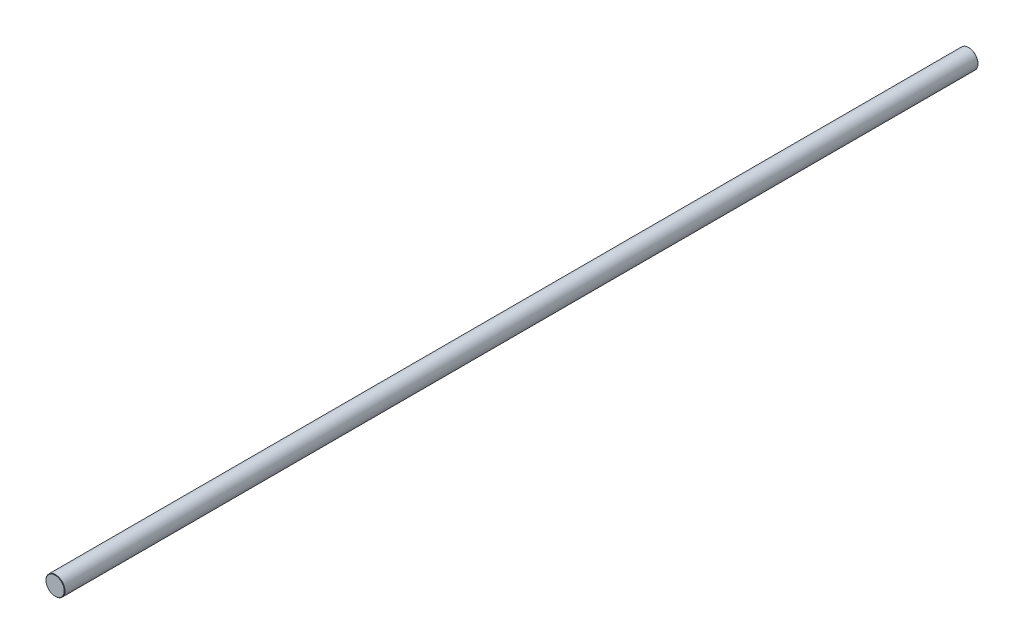
ISO-10303-21;
HEADER;
FILE_DESCRIPTION(('STEP AP214'),'2;1');
FILE_NAME('part.step','',(''),(''),'','','');
FILE_SCHEMA(('AUTOMOTIVE_DESIGN { 1 0 10303 214 1 1 1 1 }'));
ENDSEC;
DATA;
#1=APPLICATION_CONTEXT('core data for automotive mechanical design processes');
#2=APPLICATION_PROTOCOL_DEFINITION('international standard','automotive_design',2000,#1);
#3=PRODUCT_CONTEXT('',#1,'mechanical');
#4=PRODUCT('Part','Part','',(#3));
#5=PRODUCT_RELATED_PRODUCT_CATEGORY('part','',(#4));
#6=PRODUCT_DEFINITION_FORMATION('','',#4);
#7=PRODUCT_DEFINITION_CONTEXT('part definition',#1,'design');
#8=PRODUCT_DEFINITION('design','',#6,#7);
#9=PRODUCT_DEFINITION_SHAPE('','',#8);
#10=(LENGTH_UNIT() NAMED_UNIT(*) SI_UNIT(.MILLI.,.METRE.));
#11=(NAMED_UNIT(*) PLANE_ANGLE_UNIT() SI_UNIT($,.RADIAN.));
#12=(NAMED_UNIT(*) SI_UNIT($,.STERADIAN.) SOLID_ANGLE_UNIT());
#13=UNCERTAINTY_MEASURE_WITH_UNIT(LENGTH_MEASURE(1.E-05),#10,'distance_accuracy_value','');
#14=(GEOMETRIC_REPRESENTATION_CONTEXT(3) GLOBAL_UNCERTAINTY_ASSIGNED_CONTEXT((#13)) GLOBAL_UNIT_ASSIGNED_CONTEXT((#10,
#11,#12)) REPRESENTATION_CONTEXT('',''));
#15=CARTESIAN_POINT('',(0.,0.,0.));
#16=DIRECTION('',(0.,0.,1.));
#17=DIRECTION('',(1.,0.,0.));
#18=AXIS2_PLACEMENT_3D('',#15,#16,#17);
#19=CARTESIAN_POINT('',(0.,0.,600.));
#20=DIRECTION('',(0.,0.,-1.));
#21=DIRECTION('',(-1.,0.,0.));
#22=AXIS2_PLACEMENT_3D('',#19,#20,#21);
#23=CYLINDRICAL_SURFACE('',#22,12.5);
#24=CARTESIAN_POINT('',(0.,0.,-599.5));
#25=DIRECTION('',(0.,0.,1.));
#26=DIRECTION('',(1.,0.,0.));
#27=AXIS2_PLACEMENT_3D('',#24,#25,#26);
#28=CIRCLE('',#27,12.5);
#29=CARTESIAN_POINT('',(12.5,0.,-599.5));
#30=VERTEX_POINT('',#29);
#31=EDGE_CURVE('E50',#30,#30,#28,.T.);
#32=ORIENTED_EDGE('',*,*,#31,.T.);
#33=EDGE_LOOP('',(#32));
#34=FACE_BOUND('',#33,.T.);
#35=CARTESIAN_POINT('',(0.,0.,599.5));
#36=DIRECTION('',(0.,0.,1.));
#37=DIRECTION('',(1.,0.,0.));
#38=AXIS2_PLACEMENT_3D('',#35,#36,#37);
#39=CIRCLE('',#38,12.5);
#40=CARTESIAN_POINT('',(12.5,0.,599.5));
#41=VERTEX_POINT('',#40);
#42=EDGE_CURVE('E54',#41,#41,#39,.F.);
#43=ORIENTED_EDGE('',*,*,#42,.T.);
#44=EDGE_LOOP('',(#43));
#45=FACE_BOUND('',#44,.T.);
#46=ADVANCED_FACE('F39',(#34,#45),#23,.T.);
#47=CARTESIAN_POINT('',(0.,0.,600.));
#48=DIRECTION('',(0.,0.,1.));
#49=DIRECTION('',(1.,0.,0.));
#50=AXIS2_PLACEMENT_3D('',#47,#48,#49);
#51=PLANE('',#50);
#52=CARTESIAN_POINT('',(0.,0.,600.));
#53=DIRECTION('',(0.,0.,1.));
#54=DIRECTION('',(1.,0.,0.));
#55=AXIS2_PLACEMENT_3D('',#52,#53,#54);
#56=CIRCLE('',#55,11.9999999999999);
#57=CARTESIAN_POINT('',(11.9999999999999,0.,600.));
#58=VERTEX_POINT('',#57);
#59=EDGE_CURVE('E10',#58,#58,#56,.T.);
#60=ORIENTED_EDGE('',*,*,#59,.T.);
#61=EDGE_LOOP('',(#60));
#62=FACE_BOUND('',#61,.T.);
#63=ADVANCED_FACE('F70',(#62),#51,.T.);
#64=CARTESIAN_POINT('',(0.,0.,-600.));
#65=DIRECTION('',(0.,0.,1.));
#66=DIRECTION('',(1.,0.,0.));
#67=AXIS2_PLACEMENT_3D('',#64,#65,#66);
#68=PLANE('',#67);
#69=CARTESIAN_POINT('',(0.,0.,-600.));
#70=DIRECTION('',(0.,0.,1.));
#71=DIRECTION('',(1.,0.,0.));
#72=AXIS2_PLACEMENT_3D('',#69,#70,#71);
#73=CIRCLE('',#72,11.9999999999998);
#74=CARTESIAN_POINT('',(11.9999999999998,0.,-600.));
#75=VERTEX_POINT('',#74);
#76=EDGE_CURVE('E46',#75,#75,#73,.F.);
#77=ORIENTED_EDGE('',*,*,#76,.T.);
#78=EDGE_LOOP('',(#77));
#79=FACE_BOUND('',#78,.T.);
#80=ADVANCED_FACE('F67',(#79),#68,.F.);
#81=CARTESIAN_POINT('',(0.,0.,-599.5));
#82=DIRECTION('',(0.,0.,1.));
#83=DIRECTION('',(1.,0.,0.));
#84=AXIS2_PLACEMENT_3D('',#81,#82,#83);
#85=CONICAL_SURFACE('',#84,12.5,0.785398163397271);
#86=ORIENTED_EDGE('',*,*,#76,.F.);
#87=EDGE_LOOP('',(#86));
#88=FACE_BOUND('',#87,.T.);
#89=ORIENTED_EDGE('',*,*,#31,.F.);
#90=EDGE_LOOP('',(#89));
#91=FACE_BOUND('',#90,.T.);
#92=ADVANCED_FACE('F63',(#88,#91),#85,.T.);
#93=CARTESIAN_POINT('',(0.,0.,600.));
#94=DIRECTION('',(0.,0.,-1.));
#95=DIRECTION('',(-1.,0.,0.));
#96=AXIS2_PLACEMENT_3D('',#93,#94,#95);
#97=CONICAL_SURFACE('',#96,11.9999999999999,0.785398163397493);
#98=ORIENTED_EDGE('',*,*,#42,.F.);
#99=EDGE_LOOP('',(#98));
#100=FACE_BOUND('',#99,.T.);
#101=ORIENTED_EDGE('',*,*,#59,.F.);
#102=EDGE_LOOP('',(#101));
#103=FACE_BOUND('',#102,.T.);
#104=ADVANCED_FACE('F41',(#100,#103),#97,.T.);
#105=CLOSED_SHELL('',(#46,#63,#80,#92,#104));
#106=MANIFOLD_SOLID_BREP('B2',#105);
#107=ADVANCED_BREP_SHAPE_REPRESENTATION('',(#18,#106),#14);
#108=SHAPE_DEFINITION_REPRESENTATION(#9,#107);
ENDSEC;
END-ISO-10303-21;
